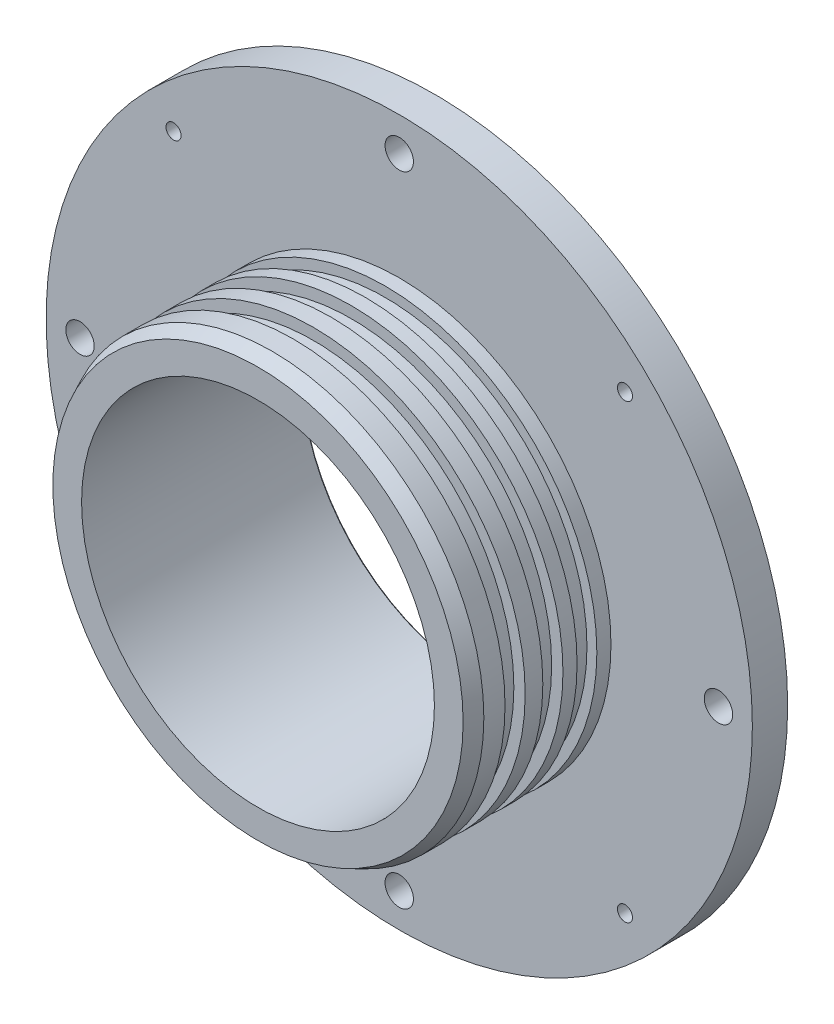
ISO-10303-21;
HEADER;
FILE_DESCRIPTION(('STEP AP214'),'2;1');
FILE_NAME('part.step','',(''),(''),'','','');
FILE_SCHEMA(('AUTOMOTIVE_DESIGN { 1 0 10303 214 1 1 1 1 }'));
ENDSEC;
DATA;
#1=APPLICATION_CONTEXT('core data for automotive mechanical design processes');
#2=APPLICATION_PROTOCOL_DEFINITION('international standard','automotive_design',2000,#1);
#3=PRODUCT_CONTEXT('',#1,'mechanical');
#4=PRODUCT('Part','Part','',(#3));
#5=PRODUCT_RELATED_PRODUCT_CATEGORY('part','',(#4));
#6=PRODUCT_DEFINITION_FORMATION('','',#4);
#7=PRODUCT_DEFINITION_CONTEXT('part definition',#1,'design');
#8=PRODUCT_DEFINITION('design','',#6,#7);
#9=PRODUCT_DEFINITION_SHAPE('','',#8);
#10=(LENGTH_UNIT() NAMED_UNIT(*) SI_UNIT(.MILLI.,.METRE.));
#11=(NAMED_UNIT(*) PLANE_ANGLE_UNIT() SI_UNIT($,.RADIAN.));
#12=(NAMED_UNIT(*) SI_UNIT($,.STERADIAN.) SOLID_ANGLE_UNIT());
#13=UNCERTAINTY_MEASURE_WITH_UNIT(LENGTH_MEASURE(1.E-05),#10,'distance_accuracy_value','');
#14=(GEOMETRIC_REPRESENTATION_CONTEXT(3) GLOBAL_UNCERTAINTY_ASSIGNED_CONTEXT((#13)) GLOBAL_UNIT_ASSIGNED_CONTEXT((#10,
#11,#12)) REPRESENTATION_CONTEXT('',''));
#15=CARTESIAN_POINT('',(0.,0.,0.));
#16=DIRECTION('',(0.,0.,1.));
#17=DIRECTION('',(1.,0.,0.));
#18=AXIS2_PLACEMENT_3D('',#15,#16,#17);
#19=CARTESIAN_POINT('',(30.7594,0.,-8.20000000000001));
#20=DIRECTION('',(0.,0.,-1.));
#21=DIRECTION('',(-1.,0.,0.));
#22=AXIS2_PLACEMENT_3D('',#19,#20,#21);
#23=PLANE('',#22);
#24=CARTESIAN_POINT('',(0.,0.,-8.20000000000001));
#25=DIRECTION('',(0.,0.,-1.));
#26=DIRECTION('',(-1.,0.,0.));
#27=AXIS2_PLACEMENT_3D('',#24,#25,#26);
#28=CIRCLE('',#27,32.0294);
#29=CARTESIAN_POINT('',(-32.0294,0.,-8.20000000000001));
#30=VERTEX_POINT('',#29);
#31=EDGE_CURVE('E47',#30,#30,#28,.F.);
#32=ORIENTED_EDGE('',*,*,#31,.T.);
#33=EDGE_LOOP('',(#32));
#34=FACE_BOUND('',#33,.T.);
#35=CARTESIAN_POINT('',(0.,0.,-8.20000000000001));
#36=DIRECTION('',(0.,0.,-1.));
#37=DIRECTION('',(-1.,0.,0.));
#38=AXIS2_PLACEMENT_3D('',#35,#36,#37);
#39=CIRCLE('',#38,44.7294);
#40=CARTESIAN_POINT('',(-44.7294,0.,-8.20000000000001));
#41=VERTEX_POINT('',#40);
#42=EDGE_CURVE('E79',#41,#41,#39,.T.);
#43=ORIENTED_EDGE('',*,*,#42,.T.);
#44=EDGE_LOOP('',(#43));
#45=FACE_BOUND('',#44,.T.);
#46=ADVANCED_FACE('F32',(#34,#45),#23,.T.);
#47=CARTESIAN_POINT('',(0.,0.,6.35));
#48=DIRECTION('',(0.,0.,1.));
#49=DIRECTION('',(1.,0.,0.));
#50=AXIS2_PLACEMENT_3D('',#47,#48,#49);
#51=CYLINDRICAL_SURFACE('',#50,45.9994);
#52=CARTESIAN_POINT('',(0.,0.,-6.93000000000001));
#53=DIRECTION('',(0.,0.,-1.));
#54=DIRECTION('',(-1.,0.,0.));
#55=AXIS2_PLACEMENT_3D('',#52,#53,#54);
#56=CIRCLE('',#55,45.9994);
#57=CARTESIAN_POINT('',(-45.9994,0.,-6.93000000000001));
#58=VERTEX_POINT('',#57);
#59=EDGE_CURVE('E43',#58,#58,#56,.F.);
#60=ORIENTED_EDGE('',*,*,#59,.T.);
#61=EDGE_LOOP('',(#60));
#62=FACE_BOUND('',#61,.T.);
#63=CARTESIAN_POINT('',(0.,0.,-5.0292));
#64=DIRECTION('',(0.,0.,1.));
#65=DIRECTION('',(1.,0.,0.));
#66=AXIS2_PLACEMENT_3D('',#63,#64,#65);
#67=CIRCLE('',#66,45.9994);
#68=CARTESIAN_POINT('',(45.9994,0.,-5.0292));
#69=VERTEX_POINT('',#68);
#70=EDGE_CURVE('E82',#69,#69,#67,.T.);
#71=ORIENTED_EDGE('',*,*,#70,.F.);
#72=EDGE_LOOP('',(#71));
#73=FACE_BOUND('',#72,.T.);
#74=ADVANCED_FACE('F290',(#62,#73),#51,.T.);
#75=CARTESIAN_POINT('',(43.2181,0.,-5.0292));
#76=DIRECTION('',(0.,0.,1.));
#77=DIRECTION('',(1.,0.,0.));
#78=AXIS2_PLACEMENT_3D('',#75,#76,#77);
#79=PLANE('',#78);
#80=ORIENTED_EDGE('',*,*,#70,.T.);
#81=EDGE_LOOP('',(#80));
#82=FACE_BOUND('',#81,.T.);
#83=CARTESIAN_POINT('',(0.,0.,-5.0292));
#84=DIRECTION('',(0.,0.,1.));
#85=DIRECTION('',(1.,0.,0.));
#86=AXIS2_PLACEMENT_3D('',#83,#84,#85);
#87=CIRCLE('',#86,43.2181);
#88=CARTESIAN_POINT('',(43.2181,0.,-5.0292));
#89=VERTEX_POINT('',#88);
#90=EDGE_CURVE('E85',#89,#89,#87,.T.);
#91=ORIENTED_EDGE('',*,*,#90,.F.);
#92=EDGE_LOOP('',(#91));
#93=FACE_BOUND('',#92,.T.);
#94=ADVANCED_FACE('F296',(#82,#93),#79,.T.);
#95=CARTESIAN_POINT('',(0.,0.,6.35));
#96=DIRECTION('',(0.,0.,1.));
#97=DIRECTION('',(1.,0.,0.));
#98=AXIS2_PLACEMENT_3D('',#95,#96,#97);
#99=CYLINDRICAL_SURFACE('',#98,43.2181);
#100=ORIENTED_EDGE('',*,*,#90,.T.);
#101=EDGE_LOOP('',(#100));
#102=FACE_BOUND('',#101,.T.);
#103=CARTESIAN_POINT('',(0.,0.,-0.253999999999997));
#104=DIRECTION('',(0.,0.,1.));
#105=DIRECTION('',(1.,0.,0.));
#106=AXIS2_PLACEMENT_3D('',#103,#104,#105);
#107=CIRCLE('',#106,43.2181);
#108=CARTESIAN_POINT('',(43.2181,0.,-0.253999999999997));
#109=VERTEX_POINT('',#108);
#110=EDGE_CURVE('E88',#109,#109,#107,.T.);
#111=ORIENTED_EDGE('',*,*,#110,.F.);
#112=EDGE_LOOP('',(#111));
#113=FACE_BOUND('',#112,.T.);
#114=ADVANCED_FACE('F323',(#102,#113),#99,.T.);
#115=CARTESIAN_POINT('',(45.9994,0.,-0.253999999999998));
#116=DIRECTION('',(0.,0.,-1.));
#117=DIRECTION('',(-1.,0.,0.));
#118=AXIS2_PLACEMENT_3D('',#115,#116,#117);
#119=PLANE('',#118);
#120=ORIENTED_EDGE('',*,*,#110,.T.);
#121=EDGE_LOOP('',(#120));
#122=FACE_BOUND('',#121,.T.);
#123=CARTESIAN_POINT('',(0.,0.,-0.253999999999998));
#124=DIRECTION('',(0.,0.,1.));
#125=DIRECTION('',(1.,0.,0.));
#126=AXIS2_PLACEMENT_3D('',#123,#124,#125);
#127=CIRCLE('',#126,45.9994);
#128=CARTESIAN_POINT('',(45.9994,0.,-0.253999999999998));
#129=VERTEX_POINT('',#128);
#130=EDGE_CURVE('E91',#129,#129,#127,.T.);
#131=ORIENTED_EDGE('',*,*,#130,.F.);
#132=EDGE_LOOP('',(#131));
#133=FACE_BOUND('',#132,.T.);
#134=ADVANCED_FACE('F328',(#122,#133),#119,.T.);
#135=CARTESIAN_POINT('',(0.,0.,6.35));
#136=DIRECTION('',(0.,0.,1.));
#137=DIRECTION('',(1.,0.,0.));
#138=AXIS2_PLACEMENT_3D('',#135,#136,#137);
#139=CYLINDRICAL_SURFACE('',#138,45.9994);
#140=ORIENTED_EDGE('',*,*,#130,.T.);
#141=EDGE_LOOP('',(#140));
#142=FACE_BOUND('',#141,.T.);
#143=CARTESIAN_POINT('',(0.,0.,0.));
#144=DIRECTION('',(0.,0.,1.));
#145=DIRECTION('',(1.,0.,0.));
#146=AXIS2_PLACEMENT_3D('',#143,#144,#145);
#147=CIRCLE('',#146,45.9994);
#148=CARTESIAN_POINT('',(45.9994,0.,0.));
#149=VERTEX_POINT('',#148);
#150=EDGE_CURVE('E94',#149,#149,#147,.T.);
#151=ORIENTED_EDGE('',*,*,#150,.F.);
#152=EDGE_LOOP('',(#151));
#153=FACE_BOUND('',#152,.T.);
#154=ADVANCED_FACE('F176',(#142,#153),#139,.T.);
#155=CARTESIAN_POINT('',(63.5,0.,0.));
#156=DIRECTION('',(0.,0.,-1.));
#157=DIRECTION('',(-1.,0.,0.));
#158=AXIS2_PLACEMENT_3D('',#155,#156,#157);
#159=PLANE('',#158);
#160=CARTESIAN_POINT('',(57.404,6.01274984324854E-13,0.));
#161=DIRECTION('',(0.,0.,-1.));
#162=DIRECTION('',(-1.,0.,0.));
#163=AXIS2_PLACEMENT_3D('',#160,#161,#162);
#164=CIRCLE('',#163,2.55269999999998);
#165=CARTESIAN_POINT('',(54.8513,6.01274984324854E-13,0.));
#166=VERTEX_POINT('',#165);
#167=EDGE_CURVE('E54',#166,#166,#164,.T.);
#168=ORIENTED_EDGE('',*,*,#167,.F.);
#169=EDGE_LOOP('',(#168));
#170=FACE_BOUND('',#169,.T.);
#171=CARTESIAN_POINT('',(0.,-57.404,0.));
#172=DIRECTION('',(0.,0.,-1.));
#173=DIRECTION('',(-1.,0.,0.));
#174=AXIS2_PLACEMENT_3D('',#171,#172,#173);
#175=CIRCLE('',#174,2.55269999999999);
#176=CARTESIAN_POINT('',(-2.55269999999999,-57.404,0.));
#177=VERTEX_POINT('',#176);
#178=EDGE_CURVE('E53',#177,#177,#175,.T.);
#179=ORIENTED_EDGE('',*,*,#178,.F.);
#180=EDGE_LOOP('',(#179));
#181=FACE_BOUND('',#180,.T.);
#182=CARTESIAN_POINT('',(-57.404,-2.00424994774951E-13,0.));
#183=DIRECTION('',(0.,0.,-1.));
#184=DIRECTION('',(-1.,0.,0.));
#185=AXIS2_PLACEMENT_3D('',#182,#183,#184);
#186=CIRCLE('',#185,2.55269999999998);
#187=CARTESIAN_POINT('',(-59.9567,-2.00424994774951E-13,0.));
#188=VERTEX_POINT('',#187);
#189=EDGE_CURVE('E58',#188,#188,#186,.T.);
#190=ORIENTED_EDGE('',*,*,#189,.F.);
#191=EDGE_LOOP('',(#190));
#192=FACE_BOUND('',#191,.T.);
#193=CARTESIAN_POINT('',(0.,57.404,0.));
#194=DIRECTION('',(0.,0.,-1.));
#195=DIRECTION('',(-1.,0.,0.));
#196=AXIS2_PLACEMENT_3D('',#193,#194,#195);
#197=CIRCLE('',#196,2.55269999999999);
#198=CARTESIAN_POINT('',(-2.55269999999999,57.404,0.));
#199=VERTEX_POINT('',#198);
#200=EDGE_CURVE('E62',#199,#199,#197,.T.);
#201=ORIENTED_EDGE('',*,*,#200,.F.);
#202=EDGE_LOOP('',(#201));
#203=FACE_BOUND('',#202,.T.);
#204=CARTESIAN_POINT('',(40.5907576672322,40.5907576672329,0.));
#205=DIRECTION('',(0.,0.,-1.));
#206=DIRECTION('',(-1.,0.,0.));
#207=AXIS2_PLACEMENT_3D('',#204,#205,#206);
#208=CIRCLE('',#207,1.35254999999999);
#209=CARTESIAN_POINT('',(39.2382076672322,40.5907576672329,0.));
#210=VERTEX_POINT('',#209);
#211=EDGE_CURVE('E66',#210,#210,#208,.T.);
#212=ORIENTED_EDGE('',*,*,#211,.F.);
#213=EDGE_LOOP('',(#212));
#214=FACE_BOUND('',#213,.T.);
#215=CARTESIAN_POINT('',(40.5907576672325,-40.5907576672326,0.));
#216=DIRECTION('',(0.,0.,-1.));
#217=DIRECTION('',(-1.,0.,0.));
#218=AXIS2_PLACEMENT_3D('',#215,#216,#217);
#219=CIRCLE('',#218,1.35254999999999);
#220=CARTESIAN_POINT('',(39.2382076672325,-40.5907576672326,0.));
#221=VERTEX_POINT('',#220);
#222=EDGE_CURVE('E153',#221,#221,#219,.T.);
#223=ORIENTED_EDGE('',*,*,#222,.F.);
#224=EDGE_LOOP('',(#223));
#225=FACE_BOUND('',#224,.T.);
#226=CARTESIAN_POINT('',(-40.5907576672325,-40.5907576672326,0.));
#227=DIRECTION('',(0.,0.,-1.));
#228=DIRECTION('',(-1.,0.,0.));
#229=AXIS2_PLACEMENT_3D('',#226,#227,#228);
#230=CIRCLE('',#229,1.35254999999999);
#231=CARTESIAN_POINT('',(-41.9433076672325,-40.5907576672326,0.));
#232=VERTEX_POINT('',#231);
#233=EDGE_CURVE('E71',#232,#232,#230,.T.);
#234=ORIENTED_EDGE('',*,*,#233,.F.);
#235=EDGE_LOOP('',(#234));
#236=FACE_BOUND('',#235,.T.);
#237=CARTESIAN_POINT('',(-40.5907576672325,40.5907576672326,0.));
#238=DIRECTION('',(0.,0.,-1.));
#239=DIRECTION('',(-1.,0.,0.));
#240=AXIS2_PLACEMENT_3D('',#237,#238,#239);
#241=CIRCLE('',#240,1.35254999999999);
#242=CARTESIAN_POINT('',(-41.9433076672325,40.5907576672326,0.));
#243=VERTEX_POINT('',#242);
#244=EDGE_CURVE('E70',#243,#243,#241,.T.);
#245=ORIENTED_EDGE('',*,*,#244,.F.);
#246=EDGE_LOOP('',(#245));
#247=FACE_BOUND('',#246,.T.);
#248=ORIENTED_EDGE('',*,*,#150,.T.);
#249=EDGE_LOOP('',(#248));
#250=FACE_BOUND('',#249,.T.);
#251=CARTESIAN_POINT('',(0.,0.,0.));
#252=DIRECTION('',(0.,0.,1.));
#253=DIRECTION('',(1.,0.,0.));
#254=AXIS2_PLACEMENT_3D('',#251,#252,#253);
#255=CIRCLE('',#254,63.5);
#256=CARTESIAN_POINT('',(63.5,0.,0.));
#257=VERTEX_POINT('',#256);
#258=EDGE_CURVE('E97',#257,#257,#255,.T.);
#259=ORIENTED_EDGE('',*,*,#258,.F.);
#260=EDGE_LOOP('',(#259));
#261=FACE_BOUND('',#260,.T.);
#262=ADVANCED_FACE('F172',(#170,#181,#192,#203,#214,#225,#236,#247,#250,#261),#159,.T.);
#263=CARTESIAN_POINT('',(0.,0.,6.35));
#264=DIRECTION('',(0.,0.,1.));
#265=DIRECTION('',(1.,0.,0.));
#266=AXIS2_PLACEMENT_3D('',#263,#264,#265);
#267=CYLINDRICAL_SURFACE('',#266,63.5);
#268=ORIENTED_EDGE('',*,*,#258,.T.);
#269=EDGE_LOOP('',(#268));
#270=FACE_BOUND('',#269,.T.);
#271=CARTESIAN_POINT('',(0.,0.,6.35));
#272=DIRECTION('',(0.,0.,1.));
#273=DIRECTION('',(1.,0.,0.));
#274=AXIS2_PLACEMENT_3D('',#271,#272,#273);
#275=CIRCLE('',#274,63.5);
#276=CARTESIAN_POINT('',(63.5,0.,6.35));
#277=VERTEX_POINT('',#276);
#278=EDGE_CURVE('E100',#277,#277,#275,.T.);
#279=ORIENTED_EDGE('',*,*,#278,.F.);
#280=EDGE_LOOP('',(#279));
#281=FACE_BOUND('',#280,.T.);
#282=ADVANCED_FACE('F175',(#270,#281),#267,.T.);
#283=CARTESIAN_POINT('',(63.5,0.,6.35000000000002));
#284=DIRECTION('',(0.,0.,1.));
#285=DIRECTION('',(1.,0.,0.));
#286=AXIS2_PLACEMENT_3D('',#283,#284,#285);
#287=PLANE('',#286);
#288=CARTESIAN_POINT('',(57.404,6.01274984324854E-13,6.35000000000002));
#289=DIRECTION('',(0.,0.,1.));
#290=DIRECTION('',(1.,0.,0.));
#291=AXIS2_PLACEMENT_3D('',#288,#289,#290);
#292=CIRCLE('',#291,2.55269999999999);
#293=CARTESIAN_POINT('',(59.9567,6.01274984324854E-13,6.35000000000002));
#294=VERTEX_POINT('',#293);
#295=EDGE_CURVE('E50',#294,#294,#292,.T.);
#296=ORIENTED_EDGE('',*,*,#295,.F.);
#297=EDGE_LOOP('',(#296));
#298=FACE_BOUND('',#297,.T.);
#299=CARTESIAN_POINT('',(0.,-57.404,6.35000000000002));
#300=DIRECTION('',(0.,0.,1.));
#301=DIRECTION('',(1.,0.,0.));
#302=AXIS2_PLACEMENT_3D('',#299,#300,#301);
#303=CIRCLE('',#302,2.55269999999999);
#304=CARTESIAN_POINT('',(2.55269999999999,-57.404,6.35000000000002));
#305=VERTEX_POINT('',#304);
#306=EDGE_CURVE('E55',#305,#305,#303,.T.);
#307=ORIENTED_EDGE('',*,*,#306,.F.);
#308=EDGE_LOOP('',(#307));
#309=FACE_BOUND('',#308,.T.);
#310=CARTESIAN_POINT('',(-57.404,-2.00424994774951E-13,6.35000000000002));
#311=DIRECTION('',(0.,0.,1.));
#312=DIRECTION('',(1.,0.,0.));
#313=AXIS2_PLACEMENT_3D('',#310,#311,#312);
#314=CIRCLE('',#313,2.55269999999999);
#315=CARTESIAN_POINT('',(-54.8513,-2.00424994774951E-13,6.35000000000002));
#316=VERTEX_POINT('',#315);
#317=EDGE_CURVE('E59',#316,#316,#314,.T.);
#318=ORIENTED_EDGE('',*,*,#317,.F.);
#319=EDGE_LOOP('',(#318));
#320=FACE_BOUND('',#319,.T.);
#321=CARTESIAN_POINT('',(0.,57.404,6.35000000000002));
#322=DIRECTION('',(0.,0.,1.));
#323=DIRECTION('',(1.,0.,0.));
#324=AXIS2_PLACEMENT_3D('',#321,#322,#323);
#325=CIRCLE('',#324,2.55269999999999);
#326=CARTESIAN_POINT('',(2.55269999999999,57.404,6.35000000000002));
#327=VERTEX_POINT('',#326);
#328=EDGE_CURVE('E63',#327,#327,#325,.T.);
#329=ORIENTED_EDGE('',*,*,#328,.F.);
#330=EDGE_LOOP('',(#329));
#331=FACE_BOUND('',#330,.T.);
#332=CARTESIAN_POINT('',(40.5907576672322,40.5907576672329,6.35000000000002));
#333=DIRECTION('',(0.,0.,1.));
#334=DIRECTION('',(1.,0.,0.));
#335=AXIS2_PLACEMENT_3D('',#332,#333,#334);
#336=CIRCLE('',#335,1.35254999999998);
#337=CARTESIAN_POINT('',(41.9433076672322,40.5907576672329,6.35000000000002));
#338=VERTEX_POINT('',#337);
#339=EDGE_CURVE('E156',#338,#338,#336,.T.);
#340=ORIENTED_EDGE('',*,*,#339,.F.);
#341=EDGE_LOOP('',(#340));
#342=FACE_BOUND('',#341,.T.);
#343=CARTESIAN_POINT('',(40.5907576672325,-40.5907576672326,6.35000000000002));
#344=DIRECTION('',(0.,0.,1.));
#345=DIRECTION('',(1.,0.,0.));
#346=AXIS2_PLACEMENT_3D('',#343,#344,#345);
#347=CIRCLE('',#346,1.35254999999998);
#348=CARTESIAN_POINT('',(41.9433076672325,-40.5907576672326,6.35000000000002));
#349=VERTEX_POINT('',#348);
#350=EDGE_CURVE('E150',#349,#349,#347,.T.);
#351=ORIENTED_EDGE('',*,*,#350,.F.);
#352=EDGE_LOOP('',(#351));
#353=FACE_BOUND('',#352,.T.);
#354=CARTESIAN_POINT('',(-40.5907576672325,-40.5907576672326,6.35000000000002));
#355=DIRECTION('',(0.,0.,1.));
#356=DIRECTION('',(1.,0.,0.));
#357=AXIS2_PLACEMENT_3D('',#354,#355,#356);
#358=CIRCLE('',#357,1.35254999999998);
#359=CARTESIAN_POINT('',(-39.2382076672325,-40.5907576672326,6.35000000000002));
#360=VERTEX_POINT('',#359);
#361=EDGE_CURVE('E67',#360,#360,#358,.T.);
#362=ORIENTED_EDGE('',*,*,#361,.F.);
#363=EDGE_LOOP('',(#362));
#364=FACE_BOUND('',#363,.T.);
#365=CARTESIAN_POINT('',(-40.5907576672325,40.5907576672326,6.35000000000002));
#366=DIRECTION('',(0.,0.,1.));
#367=DIRECTION('',(1.,0.,0.));
#368=AXIS2_PLACEMENT_3D('',#365,#366,#367);
#369=CIRCLE('',#368,1.35254999999998);
#370=CARTESIAN_POINT('',(-39.2382076672325,40.5907576672326,6.35000000000002));
#371=VERTEX_POINT('',#370);
#372=EDGE_CURVE('E75',#371,#371,#369,.T.);
#373=ORIENTED_EDGE('',*,*,#372,.F.);
#374=EDGE_LOOP('',(#373));
#375=FACE_BOUND('',#374,.T.);
#376=ORIENTED_EDGE('',*,*,#278,.T.);
#377=EDGE_LOOP('',(#376));
#378=FACE_BOUND('',#377,.T.);
#379=CARTESIAN_POINT('',(0.,0.,6.35000000000003));
#380=DIRECTION('',(0.,0.,1.));
#381=DIRECTION('',(1.,0.,0.));
#382=AXIS2_PLACEMENT_3D('',#379,#380,#381);
#383=CIRCLE('',#382,38.0746);
#384=CARTESIAN_POINT('',(38.0746,0.,6.35000000000003));
#385=VERTEX_POINT('',#384);
#386=EDGE_CURVE('E103',#385,#385,#383,.T.);
#387=ORIENTED_EDGE('',*,*,#386,.F.);
#388=EDGE_LOOP('',(#387));
#389=FACE_BOUND('',#388,.T.);
#390=ADVANCED_FACE('F198',(#298,#309,#320,#331,#342,#353,#364,#375,#378,#389),#287,.T.);
#391=CARTESIAN_POINT('',(0.,0.,6.35));
#392=DIRECTION('',(0.,0.,1.));
#393=DIRECTION('',(1.,0.,0.));
#394=AXIS2_PLACEMENT_3D('',#391,#392,#393);
#395=CYLINDRICAL_SURFACE('',#394,38.0746);
#396=ORIENTED_EDGE('',*,*,#386,.T.);
#397=EDGE_LOOP('',(#396));
#398=FACE_BOUND('',#397,.T.);
#399=CARTESIAN_POINT('',(0.,0.,8.89000000000001));
#400=DIRECTION('',(0.,0.,1.));
#401=DIRECTION('',(1.,0.,0.));
#402=AXIS2_PLACEMENT_3D('',#399,#400,#401);
#403=CIRCLE('',#402,38.0746);
#404=CARTESIAN_POINT('',(38.0746,0.,8.89000000000001));
#405=VERTEX_POINT('',#404);
#406=EDGE_CURVE('E106',#405,#405,#403,.T.);
#407=ORIENTED_EDGE('',*,*,#406,.F.);
#408=EDGE_LOOP('',(#407));
#409=FACE_BOUND('',#408,.T.);
#410=ADVANCED_FACE('F204',(#398,#409),#395,.T.);
#411=CARTESIAN_POINT('',(38.0746,0.,8.89000000000001));
#412=DIRECTION('',(0.,0.,1.));
#413=DIRECTION('',(1.,0.,0.));
#414=AXIS2_PLACEMENT_3D('',#411,#412,#413);
#415=PLANE('',#414);
#416=ORIENTED_EDGE('',*,*,#406,.T.);
#417=EDGE_LOOP('',(#416));
#418=FACE_BOUND('',#417,.T.);
#419=CARTESIAN_POINT('',(0.,0.,8.89000000000001));
#420=DIRECTION('',(0.,0.,1.));
#421=DIRECTION('',(1.,0.,0.));
#422=AXIS2_PLACEMENT_3D('',#419,#420,#421);
#423=CIRCLE('',#422,36.2966);
#424=CARTESIAN_POINT('',(36.2966,0.,8.89000000000001));
#425=VERTEX_POINT('',#424);
#426=EDGE_CURVE('E109',#425,#425,#423,.T.);
#427=ORIENTED_EDGE('',*,*,#426,.F.);
#428=EDGE_LOOP('',(#427));
#429=FACE_BOUND('',#428,.T.);
#430=ADVANCED_FACE('F211',(#418,#429),#415,.T.);
#431=CARTESIAN_POINT('',(0.,0.,6.35));
#432=DIRECTION('',(0.,0.,1.));
#433=DIRECTION('',(1.,0.,0.));
#434=AXIS2_PLACEMENT_3D('',#431,#432,#433);
#435=CYLINDRICAL_SURFACE('',#434,36.2966);
#436=ORIENTED_EDGE('',*,*,#426,.T.);
#437=EDGE_LOOP('',(#436));
#438=FACE_BOUND('',#437,.T.);
#439=CARTESIAN_POINT('',(0.,0.,12.446));
#440=DIRECTION('',(0.,0.,1.));
#441=DIRECTION('',(1.,0.,0.));
#442=AXIS2_PLACEMENT_3D('',#439,#440,#441);
#443=CIRCLE('',#442,36.2966);
#444=CARTESIAN_POINT('',(36.2966,0.,12.446));
#445=VERTEX_POINT('',#444);
#446=EDGE_CURVE('E112',#445,#445,#443,.T.);
#447=ORIENTED_EDGE('',*,*,#446,.F.);
#448=EDGE_LOOP('',(#447));
#449=FACE_BOUND('',#448,.T.);
#450=ADVANCED_FACE('F217',(#438,#449),#435,.T.);
#451=CARTESIAN_POINT('',(36.2966,0.,12.446));
#452=DIRECTION('',(0.,0.,-1.));
#453=DIRECTION('',(-1.,0.,0.));
#454=AXIS2_PLACEMENT_3D('',#451,#452,#453);
#455=PLANE('',#454);
#456=ORIENTED_EDGE('',*,*,#446,.T.);
#457=EDGE_LOOP('',(#456));
#458=FACE_BOUND('',#457,.T.);
#459=CARTESIAN_POINT('',(0.,0.,12.446));
#460=DIRECTION('',(0.,0.,1.));
#461=DIRECTION('',(1.,0.,0.));
#462=AXIS2_PLACEMENT_3D('',#459,#460,#461);
#463=CIRCLE('',#462,38.0746);
#464=CARTESIAN_POINT('',(38.0746,0.,12.446));
#465=VERTEX_POINT('',#464);
#466=EDGE_CURVE('E115',#465,#465,#463,.T.);
#467=ORIENTED_EDGE('',*,*,#466,.F.);
#468=EDGE_LOOP('',(#467));
#469=FACE_BOUND('',#468,.T.);
#470=ADVANCED_FACE('F223',(#458,#469),#455,.T.);
#471=CARTESIAN_POINT('',(0.,0.,6.35));
#472=DIRECTION('',(0.,0.,1.));
#473=DIRECTION('',(1.,0.,0.));
#474=AXIS2_PLACEMENT_3D('',#471,#472,#473);
#475=CYLINDRICAL_SURFACE('',#474,38.0746);
#476=ORIENTED_EDGE('',*,*,#466,.T.);
#477=EDGE_LOOP('',(#476));
#478=FACE_BOUND('',#477,.T.);
#479=CARTESIAN_POINT('',(0.,0.,14.9860000000001));
#480=DIRECTION('',(0.,0.,1.));
#481=DIRECTION('',(1.,0.,0.));
#482=AXIS2_PLACEMENT_3D('',#479,#480,#481);
#483=CIRCLE('',#482,38.0746);
#484=CARTESIAN_POINT('',(38.0746,0.,14.9860000000001));
#485=VERTEX_POINT('',#484);
#486=EDGE_CURVE('E118',#485,#485,#483,.T.);
#487=ORIENTED_EDGE('',*,*,#486,.F.);
#488=EDGE_LOOP('',(#487));
#489=FACE_BOUND('',#488,.T.);
#490=ADVANCED_FACE('F229',(#478,#489),#475,.T.);
#491=CARTESIAN_POINT('',(38.0746,0.,14.9860000000001));
#492=DIRECTION('',(0.,0.,1.));
#493=DIRECTION('',(1.,0.,0.));
#494=AXIS2_PLACEMENT_3D('',#491,#492,#493);
#495=PLANE('',#494);
#496=ORIENTED_EDGE('',*,*,#486,.T.);
#497=EDGE_LOOP('',(#496));
#498=FACE_BOUND('',#497,.T.);
#499=CARTESIAN_POINT('',(0.,0.,14.9860000000001));
#500=DIRECTION('',(0.,0.,1.));
#501=DIRECTION('',(1.,0.,0.));
#502=AXIS2_PLACEMENT_3D('',#499,#500,#501);
#503=CIRCLE('',#502,36.0426);
#504=CARTESIAN_POINT('',(36.0426,0.,14.9860000000001));
#505=VERTEX_POINT('',#504);
#506=EDGE_CURVE('E121',#505,#505,#503,.T.);
#507=ORIENTED_EDGE('',*,*,#506,.F.);
#508=EDGE_LOOP('',(#507));
#509=FACE_BOUND('',#508,.T.);
#510=ADVANCED_FACE('F235',(#498,#509),#495,.T.);
#511=CARTESIAN_POINT('',(0.,0.,6.35));
#512=DIRECTION('',(0.,0.,1.));
#513=DIRECTION('',(1.,0.,0.));
#514=AXIS2_PLACEMENT_3D('',#511,#512,#513);
#515=CYLINDRICAL_SURFACE('',#514,36.0426);
#516=ORIENTED_EDGE('',*,*,#506,.T.);
#517=EDGE_LOOP('',(#516));
#518=FACE_BOUND('',#517,.T.);
#519=CARTESIAN_POINT('',(0.,0.,18.6055000000001));
#520=DIRECTION('',(0.,0.,1.));
#521=DIRECTION('',(1.,0.,0.));
#522=AXIS2_PLACEMENT_3D('',#519,#520,#521);
#523=CIRCLE('',#522,36.0426);
#524=CARTESIAN_POINT('',(36.0426,0.,18.6055000000001));
#525=VERTEX_POINT('',#524);
#526=EDGE_CURVE('E124',#525,#525,#523,.T.);
#527=ORIENTED_EDGE('',*,*,#526,.F.);
#528=EDGE_LOOP('',(#527));
#529=FACE_BOUND('',#528,.T.);
#530=ADVANCED_FACE('F241',(#518,#529),#515,.T.);
#531=CARTESIAN_POINT('',(36.0426,0.,18.6055000000001));
#532=DIRECTION('',(0.,0.,-1.));
#533=DIRECTION('',(-1.,0.,0.));
#534=AXIS2_PLACEMENT_3D('',#531,#532,#533);
#535=PLANE('',#534);
#536=ORIENTED_EDGE('',*,*,#526,.T.);
#537=EDGE_LOOP('',(#536));
#538=FACE_BOUND('',#537,.T.);
#539=CARTESIAN_POINT('',(0.,0.,18.6055000000001));
#540=DIRECTION('',(0.,0.,1.));
#541=DIRECTION('',(1.,0.,0.));
#542=AXIS2_PLACEMENT_3D('',#539,#540,#541);
#543=CIRCLE('',#542,38.0746);
#544=CARTESIAN_POINT('',(38.0746,0.,18.6055000000001));
#545=VERTEX_POINT('',#544);
#546=EDGE_CURVE('E127',#545,#545,#543,.T.);
#547=ORIENTED_EDGE('',*,*,#546,.F.);
#548=EDGE_LOOP('',(#547));
#549=FACE_BOUND('',#548,.T.);
#550=ADVANCED_FACE('F247',(#538,#549),#535,.T.);
#551=CARTESIAN_POINT('',(0.,0.,6.35));
#552=DIRECTION('',(0.,0.,1.));
#553=DIRECTION('',(1.,0.,0.));
#554=AXIS2_PLACEMENT_3D('',#551,#552,#553);
#555=CYLINDRICAL_SURFACE('',#554,38.0746);
#556=ORIENTED_EDGE('',*,*,#546,.T.);
#557=EDGE_LOOP('',(#556));
#558=FACE_BOUND('',#557,.T.);
#559=CARTESIAN_POINT('',(0.,0.,21.7805000000001));
#560=DIRECTION('',(0.,0.,1.));
#561=DIRECTION('',(1.,0.,0.));
#562=AXIS2_PLACEMENT_3D('',#559,#560,#561);
#563=CIRCLE('',#562,38.0746);
#564=CARTESIAN_POINT('',(38.0746,0.,21.7805000000001));
#565=VERTEX_POINT('',#564);
#566=EDGE_CURVE('E130',#565,#565,#563,.T.);
#567=ORIENTED_EDGE('',*,*,#566,.F.);
#568=EDGE_LOOP('',(#567));
#569=FACE_BOUND('',#568,.T.);
#570=ADVANCED_FACE('F253',(#558,#569),#555,.T.);
#571=CARTESIAN_POINT('',(38.0746,0.,21.7805));
#572=DIRECTION('',(0.,0.,1.));
#573=DIRECTION('',(1.,0.,0.));
#574=AXIS2_PLACEMENT_3D('',#571,#572,#573);
#575=PLANE('',#574);
#576=ORIENTED_EDGE('',*,*,#566,.T.);
#577=EDGE_LOOP('',(#576));
#578=FACE_BOUND('',#577,.T.);
#579=CARTESIAN_POINT('',(0.,0.,21.7805));
#580=DIRECTION('',(0.,0.,1.));
#581=DIRECTION('',(1.,0.,0.));
#582=AXIS2_PLACEMENT_3D('',#579,#580,#581);
#583=CIRCLE('',#582,36.0426);
#584=CARTESIAN_POINT('',(36.0426,0.,21.7805));
#585=VERTEX_POINT('',#584);
#586=EDGE_CURVE('E133',#585,#585,#583,.T.);
#587=ORIENTED_EDGE('',*,*,#586,.F.);
#588=EDGE_LOOP('',(#587));
#589=FACE_BOUND('',#588,.T.);
#590=ADVANCED_FACE('F259',(#578,#589),#575,.T.);
#591=CARTESIAN_POINT('',(0.,0.,6.35));
#592=DIRECTION('',(0.,0.,1.));
#593=DIRECTION('',(1.,0.,0.));
#594=AXIS2_PLACEMENT_3D('',#591,#592,#593);
#595=CYLINDRICAL_SURFACE('',#594,36.0426);
#596=ORIENTED_EDGE('',*,*,#586,.T.);
#597=EDGE_LOOP('',(#596));
#598=FACE_BOUND('',#597,.T.);
#599=CARTESIAN_POINT('',(0.,0.,25.4));
#600=DIRECTION('',(0.,0.,1.));
#601=DIRECTION('',(1.,0.,0.));
#602=AXIS2_PLACEMENT_3D('',#599,#600,#601);
#603=CIRCLE('',#602,36.0426);
#604=CARTESIAN_POINT('',(36.0426,0.,25.4));
#605=VERTEX_POINT('',#604);
#606=EDGE_CURVE('E136',#605,#605,#603,.T.);
#607=ORIENTED_EDGE('',*,*,#606,.F.);
#608=EDGE_LOOP('',(#607));
#609=FACE_BOUND('',#608,.T.);
#610=ADVANCED_FACE('F265',(#598,#609),#595,.T.);
#611=CARTESIAN_POINT('',(36.0426,0.,25.4));
#612=DIRECTION('',(0.,0.,-1.));
#613=DIRECTION('',(-1.,0.,0.));
#614=AXIS2_PLACEMENT_3D('',#611,#612,#613);
#615=PLANE('',#614);
#616=ORIENTED_EDGE('',*,*,#606,.T.);
#617=EDGE_LOOP('',(#616));
#618=FACE_BOUND('',#617,.T.);
#619=CARTESIAN_POINT('',(0.,0.,25.4));
#620=DIRECTION('',(0.,0.,1.));
#621=DIRECTION('',(1.,0.,0.));
#622=AXIS2_PLACEMENT_3D('',#619,#620,#621);
#623=CIRCLE('',#622,38.0746);
#624=CARTESIAN_POINT('',(38.0746,0.,25.4));
#625=VERTEX_POINT('',#624);
#626=EDGE_CURVE('E139',#625,#625,#623,.T.);
#627=ORIENTED_EDGE('',*,*,#626,.F.);
#628=EDGE_LOOP('',(#627));
#629=FACE_BOUND('',#628,.T.);
#630=ADVANCED_FACE('F271',(#618,#629),#615,.T.);
#631=CARTESIAN_POINT('',(0.,0.,6.35));
#632=DIRECTION('',(0.,0.,1.));
#633=DIRECTION('',(1.,0.,0.));
#634=AXIS2_PLACEMENT_3D('',#631,#632,#633);
#635=CYLINDRICAL_SURFACE('',#634,38.0746);
#636=CARTESIAN_POINT('',(0.,0.,29.21));
#637=DIRECTION('',(0.,0.,1.));
#638=DIRECTION('',(1.,0.,0.));
#639=AXIS2_PLACEMENT_3D('',#636,#637,#638);
#640=CIRCLE('',#639,38.0746);
#641=CARTESIAN_POINT('',(38.0746,0.,29.21));
#642=VERTEX_POINT('',#641);
#643=EDGE_CURVE('E10',#642,#642,#640,.F.);
#644=ORIENTED_EDGE('',*,*,#643,.T.);
#645=EDGE_LOOP('',(#644));
#646=FACE_BOUND('',#645,.T.);
#647=ORIENTED_EDGE('',*,*,#626,.T.);
#648=EDGE_LOOP('',(#647));
#649=FACE_BOUND('',#648,.T.);
#650=ADVANCED_FACE('F277',(#646,#649),#635,.T.);
#651=CARTESIAN_POINT('',(38.0746,0.,31.75));
#652=DIRECTION('',(0.,0.,1.));
#653=DIRECTION('',(1.,0.,0.));
#654=AXIS2_PLACEMENT_3D('',#651,#652,#653);
#655=PLANE('',#654);
#656=CARTESIAN_POINT('',(0.,0.,31.75));
#657=DIRECTION('',(0.,0.,1.));
#658=DIRECTION('',(1.,0.,0.));
#659=AXIS2_PLACEMENT_3D('',#656,#657,#658);
#660=CIRCLE('',#659,36.8901785482863);
#661=CARTESIAN_POINT('',(36.8901785482863,0.,31.75));
#662=VERTEX_POINT('',#661);
#663=EDGE_CURVE('E39',#662,#662,#660,.T.);
#664=ORIENTED_EDGE('',*,*,#663,.T.);
#665=EDGE_LOOP('',(#664));
#666=FACE_BOUND('',#665,.T.);
#667=CARTESIAN_POINT('',(0.,0.,31.75));
#668=DIRECTION('',(0.,0.,1.));
#669=DIRECTION('',(1.,0.,0.));
#670=AXIS2_PLACEMENT_3D('',#667,#668,#669);
#671=CIRCLE('',#670,31.7246);
#672=CARTESIAN_POINT('',(31.7246,0.,31.75));
#673=VERTEX_POINT('',#672);
#674=EDGE_CURVE('E74',#673,#673,#671,.T.);
#675=ORIENTED_EDGE('',*,*,#674,.F.);
#676=EDGE_LOOP('',(#675));
#677=FACE_BOUND('',#676,.T.);
#678=ADVANCED_FACE('F282',(#666,#677),#655,.T.);
#679=CARTESIAN_POINT('',(0.,0.,6.35));
#680=DIRECTION('',(0.,0.,1.));
#681=DIRECTION('',(1.,0.,0.));
#682=AXIS2_PLACEMENT_3D('',#679,#680,#681);
#683=CYLINDRICAL_SURFACE('',#682,31.7246);
#684=ORIENTED_EDGE('',*,*,#674,.T.);
#685=EDGE_LOOP('',(#684));
#686=FACE_BOUND('',#685,.T.);
#687=CARTESIAN_POINT('',(0.,0.,-7.8952));
#688=DIRECTION('',(0.,0.,-1.));
#689=DIRECTION('',(-1.,0.,0.));
#690=AXIS2_PLACEMENT_3D('',#687,#688,#689);
#691=CIRCLE('',#690,31.7246);
#692=CARTESIAN_POINT('',(-31.7246,0.,-7.8952));
#693=VERTEX_POINT('',#692);
#694=EDGE_CURVE('E72',#693,#693,#691,.T.);
#695=ORIENTED_EDGE('',*,*,#694,.T.);
#696=EDGE_LOOP('',(#695));
#697=FACE_BOUND('',#696,.T.);
#698=ADVANCED_FACE('F287',(#686,#697),#683,.F.);
#699=CARTESIAN_POINT('',(0.,0.,-8.20000000000001));
#700=DIRECTION('',(0.,0.,-1.));
#701=DIRECTION('',(-1.,0.,0.));
#702=AXIS2_PLACEMENT_3D('',#699,#700,#701);
#703=CONICAL_SURFACE('',#702,32.0294,0.785398163397443);
#704=ORIENTED_EDGE('',*,*,#694,.F.);
#705=EDGE_LOOP('',(#704));
#706=FACE_BOUND('',#705,.T.);
#707=ORIENTED_EDGE('',*,*,#31,.F.);
#708=EDGE_LOOP('',(#707));
#709=FACE_BOUND('',#708,.T.);
#710=ADVANCED_FACE('F302',(#706,#709),#703,.F.);
#711=CARTESIAN_POINT('',(0.,0.,-6.93000000000001));
#712=DIRECTION('',(0.,0.,1.));
#713=DIRECTION('',(1.,0.,0.));
#714=AXIS2_PLACEMENT_3D('',#711,#712,#713);
#715=CONICAL_SURFACE('',#714,45.9994,0.785398163397454);
#716=ORIENTED_EDGE('',*,*,#42,.F.);
#717=EDGE_LOOP('',(#716));
#718=FACE_BOUND('',#717,.T.);
#719=ORIENTED_EDGE('',*,*,#59,.F.);
#720=EDGE_LOOP('',(#719));
#721=FACE_BOUND('',#720,.T.);
#722=ADVANCED_FACE('F304',(#718,#721),#715,.T.);
#723=CARTESIAN_POINT('',(-40.5907576672325,40.5907576672326,0.));
#724=DIRECTION('',(0.,0.,-1.));
#725=DIRECTION('',(-1.,0.,0.));
#726=AXIS2_PLACEMENT_3D('',#723,#724,#725);
#727=CYLINDRICAL_SURFACE('',#726,1.35254999999998);
#728=ORIENTED_EDGE('',*,*,#372,.T.);
#729=EDGE_LOOP('',(#728));
#730=FACE_BOUND('',#729,.T.);
#731=ORIENTED_EDGE('',*,*,#244,.T.);
#732=EDGE_LOOP('',(#731));
#733=FACE_BOUND('',#732,.T.);
#734=ADVANCED_FACE('F307',(#730,#733),#727,.F.);
#735=CARTESIAN_POINT('',(-40.5907576672325,-40.5907576672326,0.));
#736=DIRECTION('',(0.,0.,-1.));
#737=DIRECTION('',(-1.,0.,0.));
#738=AXIS2_PLACEMENT_3D('',#735,#736,#737);
#739=CYLINDRICAL_SURFACE('',#738,1.35254999999998);
#740=ORIENTED_EDGE('',*,*,#361,.T.);
#741=EDGE_LOOP('',(#740));
#742=FACE_BOUND('',#741,.T.);
#743=ORIENTED_EDGE('',*,*,#233,.T.);
#744=EDGE_LOOP('',(#743));
#745=FACE_BOUND('',#744,.T.);
#746=ADVANCED_FACE('F312',(#742,#745),#739,.F.);
#747=CARTESIAN_POINT('',(40.5907576672325,-40.5907576672326,0.));
#748=DIRECTION('',(0.,0.,-1.));
#749=DIRECTION('',(-1.,0.,0.));
#750=AXIS2_PLACEMENT_3D('',#747,#748,#749);
#751=CYLINDRICAL_SURFACE('',#750,1.35254999999998);
#752=ORIENTED_EDGE('',*,*,#350,.T.);
#753=EDGE_LOOP('',(#752));
#754=FACE_BOUND('',#753,.T.);
#755=ORIENTED_EDGE('',*,*,#222,.T.);
#756=EDGE_LOOP('',(#755));
#757=FACE_BOUND('',#756,.T.);
#758=ADVANCED_FACE('F460',(#754,#757),#751,.F.);
#759=CARTESIAN_POINT('',(40.5907576672322,40.5907576672329,0.));
#760=DIRECTION('',(0.,0.,-1.));
#761=DIRECTION('',(-1.,0.,0.));
#762=AXIS2_PLACEMENT_3D('',#759,#760,#761);
#763=CYLINDRICAL_SURFACE('',#762,1.35254999999998);
#764=ORIENTED_EDGE('',*,*,#339,.T.);
#765=EDGE_LOOP('',(#764));
#766=FACE_BOUND('',#765,.T.);
#767=ORIENTED_EDGE('',*,*,#211,.T.);
#768=EDGE_LOOP('',(#767));
#769=FACE_BOUND('',#768,.T.);
#770=ADVANCED_FACE('F470',(#766,#769),#763,.F.);
#771=CARTESIAN_POINT('',(0.,57.404,0.));
#772=DIRECTION('',(0.,0.,-1.));
#773=DIRECTION('',(-1.,0.,0.));
#774=AXIS2_PLACEMENT_3D('',#771,#772,#773);
#775=CYLINDRICAL_SURFACE('',#774,2.55269999999999);
#776=ORIENTED_EDGE('',*,*,#328,.T.);
#777=EDGE_LOOP('',(#776));
#778=FACE_BOUND('',#777,.T.);
#779=ORIENTED_EDGE('',*,*,#200,.T.);
#780=EDGE_LOOP('',(#779));
#781=FACE_BOUND('',#780,.T.);
#782=ADVANCED_FACE('F479',(#778,#781),#775,.F.);
#783=CARTESIAN_POINT('',(-57.404,-2.00424994774951E-13,0.));
#784=DIRECTION('',(0.,0.,-1.));
#785=DIRECTION('',(-1.,0.,0.));
#786=AXIS2_PLACEMENT_3D('',#783,#784,#785);
#787=CYLINDRICAL_SURFACE('',#786,2.55269999999999);
#788=ORIENTED_EDGE('',*,*,#317,.T.);
#789=EDGE_LOOP('',(#788));
#790=FACE_BOUND('',#789,.T.);
#791=ORIENTED_EDGE('',*,*,#189,.T.);
#792=EDGE_LOOP('',(#791));
#793=FACE_BOUND('',#792,.T.);
#794=ADVANCED_FACE('F488',(#790,#793),#787,.F.);
#795=CARTESIAN_POINT('',(0.,-57.404,0.));
#796=DIRECTION('',(0.,0.,-1.));
#797=DIRECTION('',(-1.,0.,0.));
#798=AXIS2_PLACEMENT_3D('',#795,#796,#797);
#799=CYLINDRICAL_SURFACE('',#798,2.55269999999999);
#800=ORIENTED_EDGE('',*,*,#306,.T.);
#801=EDGE_LOOP('',(#800));
#802=FACE_BOUND('',#801,.T.);
#803=ORIENTED_EDGE('',*,*,#178,.T.);
#804=EDGE_LOOP('',(#803));
#805=FACE_BOUND('',#804,.T.);
#806=ADVANCED_FACE('F498',(#802,#805),#799,.F.);
#807=CARTESIAN_POINT('',(57.404,6.01274984324854E-13,0.));
#808=DIRECTION('',(0.,0.,-1.));
#809=DIRECTION('',(-1.,0.,0.));
#810=AXIS2_PLACEMENT_3D('',#807,#808,#809);
#811=CYLINDRICAL_SURFACE('',#810,2.55269999999999);
#812=ORIENTED_EDGE('',*,*,#295,.T.);
#813=EDGE_LOOP('',(#812));
#814=FACE_BOUND('',#813,.T.);
#815=ORIENTED_EDGE('',*,*,#167,.T.);
#816=EDGE_LOOP('',(#815));
#817=FACE_BOUND('',#816,.T.);
#818=ADVANCED_FACE('F170',(#814,#817),#811,.F.);
#819=CARTESIAN_POINT('',(0.,0.,31.75));
#820=DIRECTION('',(0.,0.,-1.));
#821=DIRECTION('',(-1.,0.,0.));
#822=AXIS2_PLACEMENT_3D('',#819,#820,#821);
#823=CONICAL_SURFACE('',#822,36.8901785482863,0.436332312998581);
#824=ORIENTED_EDGE('',*,*,#643,.F.);
#825=EDGE_LOOP('',(#824));
#826=FACE_BOUND('',#825,.T.);
#827=ORIENTED_EDGE('',*,*,#663,.F.);
#828=EDGE_LOOP('',(#827));
#829=FACE_BOUND('',#828,.T.);
#830=ADVANCED_FACE('F34',(#826,#829),#823,.T.);
#831=CLOSED_SHELL('',(#46,#74,#94,#114,#134,#154,#262,#282,#390,#410,#430,#450,#470,#490,#510,
#530,#550,#570,#590,#610,#630,#650,#678,#698,#710,#722,#734,#746,#758,#770,#782,#794,#806,#818,#830));
#832=MANIFOLD_SOLID_BREP('B2',#831);
#833=ADVANCED_BREP_SHAPE_REPRESENTATION('',(#18,#832),#14);
#834=SHAPE_DEFINITION_REPRESENTATION(#9,#833);
ENDSEC;
END-ISO-10303-21;
